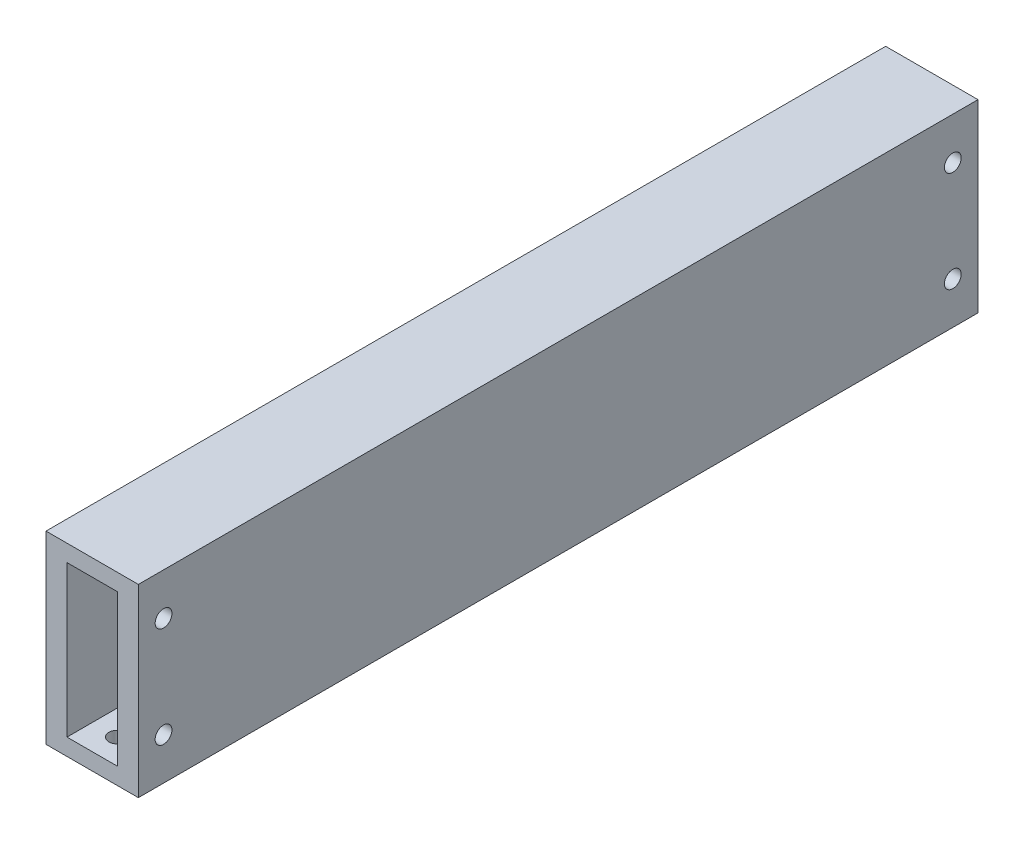
ISO-10303-21;
HEADER;
FILE_DESCRIPTION(('STEP AP214'),'2;1');
FILE_NAME('part.step','',(''),(''),'','','');
FILE_SCHEMA(('AUTOMOTIVE_DESIGN { 1 0 10303 214 1 1 1 1 }'));
ENDSEC;
DATA;
#1=APPLICATION_CONTEXT('core data for automotive mechanical design processes');
#2=APPLICATION_PROTOCOL_DEFINITION('international standard','automotive_design',2000,#1);
#3=PRODUCT_CONTEXT('',#1,'mechanical');
#4=PRODUCT('Part','Part','',(#3));
#5=PRODUCT_RELATED_PRODUCT_CATEGORY('part','',(#4));
#6=PRODUCT_DEFINITION_FORMATION('','',#4);
#7=PRODUCT_DEFINITION_CONTEXT('part definition',#1,'design');
#8=PRODUCT_DEFINITION('design','',#6,#7);
#9=PRODUCT_DEFINITION_SHAPE('','',#8);
#10=(LENGTH_UNIT() NAMED_UNIT(*) SI_UNIT(.MILLI.,.METRE.));
#11=(NAMED_UNIT(*) PLANE_ANGLE_UNIT() SI_UNIT($,.RADIAN.));
#12=(NAMED_UNIT(*) SI_UNIT($,.STERADIAN.) SOLID_ANGLE_UNIT());
#13=UNCERTAINTY_MEASURE_WITH_UNIT(LENGTH_MEASURE(1.E-05),#10,'distance_accuracy_value','');
#14=(GEOMETRIC_REPRESENTATION_CONTEXT(3) GLOBAL_UNCERTAINTY_ASSIGNED_CONTEXT((#13)) GLOBAL_UNIT_ASSIGNED_CONTEXT((#10,
#11,#12)) REPRESENTATION_CONTEXT('',''));
#15=CARTESIAN_POINT('',(0.,0.,0.));
#16=DIRECTION('',(0.,0.,1.));
#17=DIRECTION('',(1.,0.,0.));
#18=AXIS2_PLACEMENT_3D('',#15,#16,#17);
#19=CARTESIAN_POINT('',(-3.40129661339423,110.,34.4655431887367));
#20=DIRECTION('',(1.,0.,0.));
#21=DIRECTION('',(0.,0.,-1.));
#22=AXIS2_PLACEMENT_3D('',#19,#20,#21);
#23=PLANE('',#22);
#24=DIRECTION('',(0.,0.,1.));
#25=VECTOR('',#24,1.);
#26=CARTESIAN_POINT('',(-3.40129661339423,0.,34.4655431887367));
#27=LINE('',#26,#25);
#28=CARTESIAN_POINT('',(-3.40129661339423,0.,-465.534456811263));
#29=VERTEX_POINT('',#28);
#30=CARTESIAN_POINT('',(-3.40129661339423,0.,34.4655431887367));
#31=VERTEX_POINT('',#30);
#32=EDGE_CURVE('E132',#29,#31,#27,.T.);
#33=ORIENTED_EDGE('',*,*,#32,.T.);
#34=DIRECTION('',(0.,-1.,0.));
#35=VECTOR('',#34,1.);
#36=CARTESIAN_POINT('',(-3.40129661339423,110.,34.4655431887367));
#37=LINE('',#36,#35);
#38=CARTESIAN_POINT('',(-3.40129661339423,110.,34.4655431887367));
#39=VERTEX_POINT('',#38);
#40=EDGE_CURVE('E11',#39,#31,#37,.T.);
#41=ORIENTED_EDGE('',*,*,#40,.F.);
#42=DIRECTION('',(0.,0.,1.));
#43=VECTOR('',#42,1.);
#44=CARTESIAN_POINT('',(-3.40129661339423,110.,34.4655431887367));
#45=LINE('',#44,#43);
#46=CARTESIAN_POINT('',(-3.40129661339423,110.,-465.534456811263));
#47=VERTEX_POINT('',#46);
#48=EDGE_CURVE('E136',#47,#39,#45,.T.);
#49=ORIENTED_EDGE('',*,*,#48,.F.);
#50=DIRECTION('',(0.,-1.,0.));
#51=VECTOR('',#50,1.);
#52=CARTESIAN_POINT('',(-3.40129661339423,110.,-465.534456811263));
#53=LINE('',#52,#51);
#54=EDGE_CURVE('E146',#47,#29,#53,.T.);
#55=ORIENTED_EDGE('',*,*,#54,.T.);
#56=EDGE_LOOP('',(#33,#41,#49,#55));
#57=FACE_BOUND('',#56,.T.);
#58=ADVANCED_FACE('F32',(#57),#23,.F.);
#59=CARTESIAN_POINT('',(-3.40129661339423,110.,34.4655431887367));
#60=DIRECTION('',(0.,0.,-1.));
#61=DIRECTION('',(-1.,0.,0.));
#62=AXIS2_PLACEMENT_3D('',#59,#60,#61);
#63=PLANE('',#62);
#64=DIRECTION('',(0.,1.,0.));
#65=VECTOR('',#64,1.);
#66=CARTESIAN_POINT('',(39.0987033866058,0.,34.4655431887367));
#67=LINE('',#66,#65);
#68=CARTESIAN_POINT('',(39.0987033866058,10.,34.4655431887367));
#69=VERTEX_POINT('',#68);
#70=CARTESIAN_POINT('',(39.0987033866058,100.,34.4655431887367));
#71=VERTEX_POINT('',#70);
#72=EDGE_CURVE('E126',#69,#71,#67,.T.);
#73=ORIENTED_EDGE('',*,*,#72,.F.);
#74=DIRECTION('',(1.,0.,0.));
#75=VECTOR('',#74,1.);
#76=CARTESIAN_POINT('',(0.,10.,34.4655431887367));
#77=LINE('',#76,#75);
#78=CARTESIAN_POINT('',(9.09870338660576,10.,34.4655431887367));
#79=VERTEX_POINT('',#78);
#80=EDGE_CURVE('E48',#79,#69,#77,.T.);
#81=ORIENTED_EDGE('',*,*,#80,.F.);
#82=DIRECTION('',(0.,1.,0.));
#83=VECTOR('',#82,1.);
#84=CARTESIAN_POINT('',(9.09870338660576,0.,34.4655431887367));
#85=LINE('',#84,#83);
#86=CARTESIAN_POINT('',(9.09870338660576,100.,34.4655431887367));
#87=VERTEX_POINT('',#86);
#88=EDGE_CURVE('E114',#79,#87,#85,.T.);
#89=ORIENTED_EDGE('',*,*,#88,.T.);
#90=DIRECTION('',(1.,0.,0.));
#91=VECTOR('',#90,1.);
#92=CARTESIAN_POINT('',(0.,100.,34.4655431887367));
#93=LINE('',#92,#91);
#94=EDGE_CURVE('E117',#87,#71,#93,.T.);
#95=ORIENTED_EDGE('',*,*,#94,.T.);
#96=EDGE_LOOP('',(#73,#81,#89,#95));
#97=FACE_BOUND('',#96,.T.);
#98=DIRECTION('',(1.,0.,0.));
#99=VECTOR('',#98,1.);
#100=CARTESIAN_POINT('',(-3.40129661339423,0.,34.4655431887367));
#101=LINE('',#100,#99);
#102=CARTESIAN_POINT('',(51.5987033866058,0.,34.4655431887367));
#103=VERTEX_POINT('',#102);
#104=EDGE_CURVE('E149',#31,#103,#101,.T.);
#105=ORIENTED_EDGE('',*,*,#104,.T.);
#106=DIRECTION('',(0.,-1.,0.));
#107=VECTOR('',#106,1.);
#108=CARTESIAN_POINT('',(51.5987033866058,110.,34.4655431887367));
#109=LINE('',#108,#107);
#110=CARTESIAN_POINT('',(51.5987033866058,110.,34.4655431887367));
#111=VERTEX_POINT('',#110);
#112=EDGE_CURVE('E40',#111,#103,#109,.T.);
#113=ORIENTED_EDGE('',*,*,#112,.F.);
#114=DIRECTION('',(1.,0.,0.));
#115=VECTOR('',#114,1.);
#116=CARTESIAN_POINT('',(-3.40129661339423,110.,34.4655431887367));
#117=LINE('',#116,#115);
#118=EDGE_CURVE('E139',#39,#111,#117,.T.);
#119=ORIENTED_EDGE('',*,*,#118,.F.);
#120=ORIENTED_EDGE('',*,*,#40,.T.);
#121=EDGE_LOOP('',(#105,#113,#119,#120));
#122=FACE_BOUND('',#121,.T.);
#123=ADVANCED_FACE('F219',(#97,#122),#63,.F.);
#124=CARTESIAN_POINT('',(51.5987033866058,110.,34.4655431887367));
#125=DIRECTION('',(-1.,0.,0.));
#126=DIRECTION('',(0.,0.,1.));
#127=AXIS2_PLACEMENT_3D('',#124,#125,#126);
#128=PLANE('',#127);
#129=CARTESIAN_POINT('',(51.5987033866058,85.,-450.534456811263));
#130=DIRECTION('',(1.,0.,0.));
#131=DIRECTION('',(0.,0.,-1.));
#132=AXIS2_PLACEMENT_3D('',#129,#130,#131);
#133=CIRCLE('',#132,5.);
#134=CARTESIAN_POINT('',(51.5987033866058,85.,-455.534456811263));
#135=VERTEX_POINT('',#134);
#136=EDGE_CURVE('E177',#135,#135,#133,.T.);
#137=ORIENTED_EDGE('',*,*,#136,.F.);
#138=EDGE_LOOP('',(#137));
#139=FACE_BOUND('',#138,.T.);
#140=CARTESIAN_POINT('',(51.5987033866058,25.,-450.534456811263));
#141=DIRECTION('',(1.,0.,0.));
#142=DIRECTION('',(0.,0.,-1.));
#143=AXIS2_PLACEMENT_3D('',#140,#141,#142);
#144=CIRCLE('',#143,5.);
#145=CARTESIAN_POINT('',(51.5987033866058,25.,-455.534456811263));
#146=VERTEX_POINT('',#145);
#147=EDGE_CURVE('E167',#146,#146,#144,.T.);
#148=ORIENTED_EDGE('',*,*,#147,.F.);
#149=EDGE_LOOP('',(#148));
#150=FACE_BOUND('',#149,.T.);
#151=CARTESIAN_POINT('',(51.5987033866058,85.,19.4655431887367));
#152=DIRECTION('',(1.,0.,0.));
#153=DIRECTION('',(0.,0.,-1.));
#154=AXIS2_PLACEMENT_3D('',#151,#152,#153);
#155=CIRCLE('',#154,5.);
#156=CARTESIAN_POINT('',(51.5987033866058,85.,14.4655431887367));
#157=VERTEX_POINT('',#156);
#158=EDGE_CURVE('E164',#157,#157,#155,.T.);
#159=ORIENTED_EDGE('',*,*,#158,.F.);
#160=EDGE_LOOP('',(#159));
#161=FACE_BOUND('',#160,.T.);
#162=CARTESIAN_POINT('',(51.5987033866058,25.,19.4655431887367));
#163=DIRECTION('',(1.,0.,0.));
#164=DIRECTION('',(0.,0.,-1.));
#165=AXIS2_PLACEMENT_3D('',#162,#163,#164);
#166=CIRCLE('',#165,5.);
#167=CARTESIAN_POINT('',(51.5987033866058,25.,14.4655431887367));
#168=VERTEX_POINT('',#167);
#169=EDGE_CURVE('E163',#168,#168,#166,.T.);
#170=ORIENTED_EDGE('',*,*,#169,.F.);
#171=EDGE_LOOP('',(#170));
#172=FACE_BOUND('',#171,.T.);
#173=DIRECTION('',(0.,0.,-1.));
#174=VECTOR('',#173,1.);
#175=CARTESIAN_POINT('',(51.5987033866058,0.,34.4655431887367));
#176=LINE('',#175,#174);
#177=CARTESIAN_POINT('',(51.5987033866058,0.,-465.534456811263));
#178=VERTEX_POINT('',#177);
#179=EDGE_CURVE('E151',#103,#178,#176,.T.);
#180=ORIENTED_EDGE('',*,*,#179,.T.);
#181=DIRECTION('',(0.,-1.,0.));
#182=VECTOR('',#181,1.);
#183=CARTESIAN_POINT('',(51.5987033866058,110.,-465.534456811263));
#184=LINE('',#183,#182);
#185=CARTESIAN_POINT('',(51.5987033866058,110.,-465.534456811263));
#186=VERTEX_POINT('',#185);
#187=EDGE_CURVE('E156',#186,#178,#184,.T.);
#188=ORIENTED_EDGE('',*,*,#187,.F.);
#189=DIRECTION('',(0.,0.,-1.));
#190=VECTOR('',#189,1.);
#191=CARTESIAN_POINT('',(51.5987033866058,110.,34.4655431887367));
#192=LINE('',#191,#190);
#193=EDGE_CURVE('E142',#111,#186,#192,.T.);
#194=ORIENTED_EDGE('',*,*,#193,.F.);
#195=ORIENTED_EDGE('',*,*,#112,.T.);
#196=EDGE_LOOP('',(#180,#188,#194,#195));
#197=FACE_BOUND('',#196,.T.);
#198=ADVANCED_FACE('F216',(#139,#150,#161,#172,#197),#128,.F.);
#199=CARTESIAN_POINT('',(-3.40129661339423,110.,-465.534456811263));
#200=DIRECTION('',(0.,0.,1.));
#201=DIRECTION('',(1.,0.,0.));
#202=AXIS2_PLACEMENT_3D('',#199,#200,#201);
#203=PLANE('',#202);
#204=DIRECTION('',(0.,1.,0.));
#205=VECTOR('',#204,1.);
#206=CARTESIAN_POINT('',(9.09870338660576,0.,-465.534456811263));
#207=LINE('',#206,#205);
#208=CARTESIAN_POINT('',(9.09870338660576,10.,-465.534456811263));
#209=VERTEX_POINT('',#208);
#210=CARTESIAN_POINT('',(9.09870338660576,100.,-465.534456811263));
#211=VERTEX_POINT('',#210);
#212=EDGE_CURVE('E103',#209,#211,#207,.T.);
#213=ORIENTED_EDGE('',*,*,#212,.F.);
#214=DIRECTION('',(1.,0.,0.));
#215=VECTOR('',#214,1.);
#216=CARTESIAN_POINT('',(0.,10.,-465.534456811263));
#217=LINE('',#216,#215);
#218=CARTESIAN_POINT('',(39.0987033866058,10.,-465.534456811263));
#219=VERTEX_POINT('',#218);
#220=EDGE_CURVE('E100',#209,#219,#217,.T.);
#221=ORIENTED_EDGE('',*,*,#220,.T.);
#222=DIRECTION('',(0.,1.,0.));
#223=VECTOR('',#222,1.);
#224=CARTESIAN_POINT('',(39.0987033866058,0.,-465.534456811263));
#225=LINE('',#224,#223);
#226=CARTESIAN_POINT('',(39.0987033866058,100.,-465.534456811263));
#227=VERTEX_POINT('',#226);
#228=EDGE_CURVE('E106',#219,#227,#225,.T.);
#229=ORIENTED_EDGE('',*,*,#228,.T.);
#230=DIRECTION('',(1.,0.,0.));
#231=VECTOR('',#230,1.);
#232=CARTESIAN_POINT('',(0.,100.,-465.534456811263));
#233=LINE('',#232,#231);
#234=EDGE_CURVE('E110',#211,#227,#233,.T.);
#235=ORIENTED_EDGE('',*,*,#234,.F.);
#236=EDGE_LOOP('',(#213,#221,#229,#235));
#237=FACE_BOUND('',#236,.T.);
#238=DIRECTION('',(-1.,0.,0.));
#239=VECTOR('',#238,1.);
#240=CARTESIAN_POINT('',(-3.40129661339423,0.,-465.534456811263));
#241=LINE('',#240,#239);
#242=EDGE_CURVE('E140',#178,#29,#241,.T.);
#243=ORIENTED_EDGE('',*,*,#242,.T.);
#244=ORIENTED_EDGE('',*,*,#54,.F.);
#245=DIRECTION('',(-1.,0.,0.));
#246=VECTOR('',#245,1.);
#247=CARTESIAN_POINT('',(-3.40129661339423,110.,-465.534456811263));
#248=LINE('',#247,#246);
#249=EDGE_CURVE('E144',#186,#47,#248,.T.);
#250=ORIENTED_EDGE('',*,*,#249,.F.);
#251=ORIENTED_EDGE('',*,*,#187,.T.);
#252=EDGE_LOOP('',(#243,#244,#250,#251));
#253=FACE_BOUND('',#252,.T.);
#254=ADVANCED_FACE('F112',(#237,#253),#203,.F.);
#255=CARTESIAN_POINT('',(0.,110.,0.));
#256=DIRECTION('',(0.,-1.,0.));
#257=DIRECTION('',(0.,0.,-1.));
#258=AXIS2_PLACEMENT_3D('',#255,#256,#257);
#259=PLANE('',#258);
#260=ORIENTED_EDGE('',*,*,#48,.T.);
#261=ORIENTED_EDGE('',*,*,#118,.T.);
#262=ORIENTED_EDGE('',*,*,#193,.T.);
#263=ORIENTED_EDGE('',*,*,#249,.T.);
#264=EDGE_LOOP('',(#260,#261,#262,#263));
#265=FACE_BOUND('',#264,.T.);
#266=ADVANCED_FACE('F202',(#265),#259,.F.);
#267=CARTESIAN_POINT('',(0.,0.,0.));
#268=DIRECTION('',(0.,-1.,0.));
#269=DIRECTION('',(0.,0.,-1.));
#270=AXIS2_PLACEMENT_3D('',#267,#268,#269);
#271=PLANE('',#270);
#272=CARTESIAN_POINT('',(24.0987033866058,0.,-450.534456811263));
#273=DIRECTION('',(0.,-1.,0.));
#274=DIRECTION('',(0.,0.,-1.));
#275=AXIS2_PLACEMENT_3D('',#272,#273,#274);
#276=CIRCLE('',#275,5.);
#277=CARTESIAN_POINT('',(24.0987033866058,0.,-455.534456811263));
#278=VERTEX_POINT('',#277);
#279=EDGE_CURVE('E188',#278,#278,#276,.T.);
#280=ORIENTED_EDGE('',*,*,#279,.F.);
#281=EDGE_LOOP('',(#280));
#282=FACE_BOUND('',#281,.T.);
#283=CARTESIAN_POINT('',(24.0987033866058,0.,19.4655431887367));
#284=DIRECTION('',(0.,-1.,0.));
#285=DIRECTION('',(0.,0.,-1.));
#286=AXIS2_PLACEMENT_3D('',#283,#284,#285);
#287=CIRCLE('',#286,5.);
#288=CARTESIAN_POINT('',(24.0987033866058,0.,14.4655431887367));
#289=VERTEX_POINT('',#288);
#290=EDGE_CURVE('E120',#289,#289,#287,.T.);
#291=ORIENTED_EDGE('',*,*,#290,.F.);
#292=EDGE_LOOP('',(#291));
#293=FACE_BOUND('',#292,.T.);
#294=ORIENTED_EDGE('',*,*,#32,.F.);
#295=ORIENTED_EDGE('',*,*,#242,.F.);
#296=ORIENTED_EDGE('',*,*,#179,.F.);
#297=ORIENTED_EDGE('',*,*,#104,.F.);
#298=EDGE_LOOP('',(#294,#295,#296,#297));
#299=FACE_BOUND('',#298,.T.);
#300=ADVANCED_FACE('F199',(#282,#293,#299),#271,.T.);
#301=CARTESIAN_POINT('',(0.,10.,-465.534456811263));
#302=DIRECTION('',(0.,-1.,0.));
#303=DIRECTION('',(0.,0.,-1.));
#304=AXIS2_PLACEMENT_3D('',#301,#302,#303);
#305=PLANE('',#304);
#306=CARTESIAN_POINT('',(24.0987033866058,10.,-450.534456811263));
#307=DIRECTION('',(0.,1.,0.));
#308=DIRECTION('',(0.,0.,1.));
#309=AXIS2_PLACEMENT_3D('',#306,#307,#308);
#310=CIRCLE('',#309,5.);
#311=CARTESIAN_POINT('',(24.0987033866058,10.,-445.534456811263));
#312=VERTEX_POINT('',#311);
#313=EDGE_CURVE('E185',#312,#312,#310,.T.);
#314=ORIENTED_EDGE('',*,*,#313,.F.);
#315=EDGE_LOOP('',(#314));
#316=FACE_BOUND('',#315,.T.);
#317=CARTESIAN_POINT('',(24.0987033866058,10.,19.4655431887367));
#318=DIRECTION('',(0.,1.,0.));
#319=DIRECTION('',(0.,0.,1.));
#320=AXIS2_PLACEMENT_3D('',#317,#318,#319);
#321=CIRCLE('',#320,5.);
#322=CARTESIAN_POINT('',(24.0987033866058,10.,24.4655431887367));
#323=VERTEX_POINT('',#322);
#324=EDGE_CURVE('E190',#323,#323,#321,.T.);
#325=ORIENTED_EDGE('',*,*,#324,.F.);
#326=EDGE_LOOP('',(#325));
#327=FACE_BOUND('',#326,.T.);
#328=ORIENTED_EDGE('',*,*,#80,.T.);
#329=DIRECTION('',(0.,0.,1.));
#330=VECTOR('',#329,1.);
#331=CARTESIAN_POINT('',(39.0987033866058,10.,-465.534456811263));
#332=LINE('',#331,#330);
#333=EDGE_CURVE('E97',#219,#69,#332,.T.);
#334=ORIENTED_EDGE('',*,*,#333,.F.);
#335=ORIENTED_EDGE('',*,*,#220,.F.);
#336=DIRECTION('',(0.,0.,1.));
#337=VECTOR('',#336,1.);
#338=CARTESIAN_POINT('',(9.09870338660576,10.,-465.534456811263));
#339=LINE('',#338,#337);
#340=EDGE_CURVE('E130',#209,#79,#339,.T.);
#341=ORIENTED_EDGE('',*,*,#340,.T.);
#342=EDGE_LOOP('',(#328,#334,#335,#341));
#343=FACE_BOUND('',#342,.T.);
#344=ADVANCED_FACE('F98',(#316,#327,#343),#305,.F.);
#345=CARTESIAN_POINT('',(9.09870338660576,0.,-465.534456811263));
#346=DIRECTION('',(1.,0.,0.));
#347=DIRECTION('',(0.,0.,-1.));
#348=AXIS2_PLACEMENT_3D('',#345,#346,#347);
#349=PLANE('',#348);
#350=ORIENTED_EDGE('',*,*,#88,.F.);
#351=ORIENTED_EDGE('',*,*,#340,.F.);
#352=ORIENTED_EDGE('',*,*,#212,.T.);
#353=DIRECTION('',(0.,0.,1.));
#354=VECTOR('',#353,1.);
#355=CARTESIAN_POINT('',(9.09870338660576,100.,-465.534456811263));
#356=LINE('',#355,#354);
#357=EDGE_CURVE('E133',#211,#87,#356,.T.);
#358=ORIENTED_EDGE('',*,*,#357,.T.);
#359=EDGE_LOOP('',(#350,#351,#352,#358));
#360=FACE_BOUND('',#359,.T.);
#361=ADVANCED_FACE('F244',(#360),#349,.T.);
#362=CARTESIAN_POINT('',(0.,100.,-465.534456811263));
#363=DIRECTION('',(0.,-1.,0.));
#364=DIRECTION('',(0.,0.,-1.));
#365=AXIS2_PLACEMENT_3D('',#362,#363,#364);
#366=PLANE('',#365);
#367=ORIENTED_EDGE('',*,*,#94,.F.);
#368=ORIENTED_EDGE('',*,*,#357,.F.);
#369=ORIENTED_EDGE('',*,*,#234,.T.);
#370=DIRECTION('',(0.,0.,1.));
#371=VECTOR('',#370,1.);
#372=CARTESIAN_POINT('',(39.0987033866058,100.,-465.534456811263));
#373=LINE('',#372,#371);
#374=EDGE_CURVE('E56',#227,#71,#373,.T.);
#375=ORIENTED_EDGE('',*,*,#374,.T.);
#376=EDGE_LOOP('',(#367,#368,#369,#375));
#377=FACE_BOUND('',#376,.T.);
#378=ADVANCED_FACE('F242',(#377),#366,.T.);
#379=CARTESIAN_POINT('',(39.0987033866058,0.,-465.534456811263));
#380=DIRECTION('',(1.,0.,0.));
#381=DIRECTION('',(0.,0.,-1.));
#382=AXIS2_PLACEMENT_3D('',#379,#380,#381);
#383=PLANE('',#382);
#384=CARTESIAN_POINT('',(39.0987033866058,85.,-450.534456811263));
#385=DIRECTION('',(1.,0.,0.));
#386=DIRECTION('',(0.,0.,-1.));
#387=AXIS2_PLACEMENT_3D('',#384,#385,#386);
#388=CIRCLE('',#387,5.);
#389=CARTESIAN_POINT('',(39.0987033866058,85.,-455.534456811263));
#390=VERTEX_POINT('',#389);
#391=EDGE_CURVE('E35',#390,#390,#388,.T.);
#392=ORIENTED_EDGE('',*,*,#391,.T.);
#393=EDGE_LOOP('',(#392));
#394=FACE_BOUND('',#393,.T.);
#395=CARTESIAN_POINT('',(39.0987033866058,25.,-450.534456811263));
#396=DIRECTION('',(1.,0.,0.));
#397=DIRECTION('',(0.,0.,-1.));
#398=AXIS2_PLACEMENT_3D('',#395,#396,#397);
#399=CIRCLE('',#398,5.);
#400=CARTESIAN_POINT('',(39.0987033866058,25.,-455.534456811263));
#401=VERTEX_POINT('',#400);
#402=EDGE_CURVE('E165',#401,#401,#399,.T.);
#403=ORIENTED_EDGE('',*,*,#402,.T.);
#404=EDGE_LOOP('',(#403));
#405=FACE_BOUND('',#404,.T.);
#406=CARTESIAN_POINT('',(39.0987033866058,85.,19.4655431887367));
#407=DIRECTION('',(1.,0.,0.));
#408=DIRECTION('',(0.,0.,-1.));
#409=AXIS2_PLACEMENT_3D('',#406,#407,#408);
#410=CIRCLE('',#409,5.);
#411=CARTESIAN_POINT('',(39.0987033866058,85.,14.4655431887367));
#412=VERTEX_POINT('',#411);
#413=EDGE_CURVE('E161',#412,#412,#410,.T.);
#414=ORIENTED_EDGE('',*,*,#413,.T.);
#415=EDGE_LOOP('',(#414));
#416=FACE_BOUND('',#415,.T.);
#417=CARTESIAN_POINT('',(39.0987033866058,25.,19.4655431887367));
#418=DIRECTION('',(1.,0.,0.));
#419=DIRECTION('',(0.,0.,-1.));
#420=AXIS2_PLACEMENT_3D('',#417,#418,#419);
#421=CIRCLE('',#420,5.);
#422=CARTESIAN_POINT('',(39.0987033866058,25.,14.4655431887367));
#423=VERTEX_POINT('',#422);
#424=EDGE_CURVE('E182',#423,#423,#421,.T.);
#425=ORIENTED_EDGE('',*,*,#424,.T.);
#426=EDGE_LOOP('',(#425));
#427=FACE_BOUND('',#426,.T.);
#428=ORIENTED_EDGE('',*,*,#72,.T.);
#429=ORIENTED_EDGE('',*,*,#374,.F.);
#430=ORIENTED_EDGE('',*,*,#228,.F.);
#431=ORIENTED_EDGE('',*,*,#333,.T.);
#432=EDGE_LOOP('',(#428,#429,#430,#431));
#433=FACE_BOUND('',#432,.T.);
#434=ADVANCED_FACE('F107',(#394,#405,#416,#427,#433),#383,.F.);
#435=CARTESIAN_POINT('',(24.0987033866058,10.,19.4655431887367));
#436=DIRECTION('',(0.,1.,0.));
#437=DIRECTION('',(0.,0.,1.));
#438=AXIS2_PLACEMENT_3D('',#435,#436,#437);
#439=CYLINDRICAL_SURFACE('',#438,5.);
#440=ORIENTED_EDGE('',*,*,#290,.T.);
#441=EDGE_LOOP('',(#440));
#442=FACE_BOUND('',#441,.T.);
#443=ORIENTED_EDGE('',*,*,#324,.T.);
#444=EDGE_LOOP('',(#443));
#445=FACE_BOUND('',#444,.T.);
#446=ADVANCED_FACE('F197',(#442,#445),#439,.F.);
#447=CARTESIAN_POINT('',(24.0987033866058,10.,-450.534456811263));
#448=DIRECTION('',(0.,1.,0.));
#449=DIRECTION('',(0.,0.,1.));
#450=AXIS2_PLACEMENT_3D('',#447,#448,#449);
#451=CYLINDRICAL_SURFACE('',#450,5.);
#452=ORIENTED_EDGE('',*,*,#279,.T.);
#453=EDGE_LOOP('',(#452));
#454=FACE_BOUND('',#453,.T.);
#455=ORIENTED_EDGE('',*,*,#313,.T.);
#456=EDGE_LOOP('',(#455));
#457=FACE_BOUND('',#456,.T.);
#458=ADVANCED_FACE('F261',(#454,#457),#451,.F.);
#459=CARTESIAN_POINT('',(51.5987033866058,25.,19.4655431887367));
#460=DIRECTION('',(1.,0.,0.));
#461=DIRECTION('',(0.,0.,-1.));
#462=AXIS2_PLACEMENT_3D('',#459,#460,#461);
#463=CYLINDRICAL_SURFACE('',#462,5.);
#464=ORIENTED_EDGE('',*,*,#169,.T.);
#465=EDGE_LOOP('',(#464));
#466=FACE_BOUND('',#465,.T.);
#467=ORIENTED_EDGE('',*,*,#424,.F.);
#468=EDGE_LOOP('',(#467));
#469=FACE_BOUND('',#468,.T.);
#470=ADVANCED_FACE('F268',(#466,#469),#463,.F.);
#471=CARTESIAN_POINT('',(51.5987033866058,85.,19.4655431887367));
#472=DIRECTION('',(1.,0.,0.));
#473=DIRECTION('',(0.,0.,-1.));
#474=AXIS2_PLACEMENT_3D('',#471,#472,#473);
#475=CYLINDRICAL_SURFACE('',#474,5.);
#476=ORIENTED_EDGE('',*,*,#158,.T.);
#477=EDGE_LOOP('',(#476));
#478=FACE_BOUND('',#477,.T.);
#479=ORIENTED_EDGE('',*,*,#413,.F.);
#480=EDGE_LOOP('',(#479));
#481=FACE_BOUND('',#480,.T.);
#482=ADVANCED_FACE('F270',(#478,#481),#475,.F.);
#483=CARTESIAN_POINT('',(51.5987033866058,25.,-450.534456811263));
#484=DIRECTION('',(1.,0.,0.));
#485=DIRECTION('',(0.,0.,-1.));
#486=AXIS2_PLACEMENT_3D('',#483,#484,#485);
#487=CYLINDRICAL_SURFACE('',#486,5.);
#488=ORIENTED_EDGE('',*,*,#147,.T.);
#489=EDGE_LOOP('',(#488));
#490=FACE_BOUND('',#489,.T.);
#491=ORIENTED_EDGE('',*,*,#402,.F.);
#492=EDGE_LOOP('',(#491));
#493=FACE_BOUND('',#492,.T.);
#494=ADVANCED_FACE('F277',(#490,#493),#487,.F.);
#495=CARTESIAN_POINT('',(51.5987033866058,85.,-450.534456811263));
#496=DIRECTION('',(1.,0.,0.));
#497=DIRECTION('',(0.,0.,-1.));
#498=AXIS2_PLACEMENT_3D('',#495,#496,#497);
#499=CYLINDRICAL_SURFACE('',#498,5.);
#500=ORIENTED_EDGE('',*,*,#136,.T.);
#501=EDGE_LOOP('',(#500));
#502=FACE_BOUND('',#501,.T.);
#503=ORIENTED_EDGE('',*,*,#391,.F.);
#504=EDGE_LOOP('',(#503));
#505=FACE_BOUND('',#504,.T.);
#506=ADVANCED_FACE('F284',(#502,#505),#499,.F.);
#507=CLOSED_SHELL('',(#58,#123,#198,#254,#266,#300,#344,#361,#378,#434,#446,#458,#470,#482,#494,#506));
#508=MANIFOLD_SOLID_BREP('B2',#507);
#509=ADVANCED_BREP_SHAPE_REPRESENTATION('',(#18,#508),#14);
#510=SHAPE_DEFINITION_REPRESENTATION(#9,#509);
ENDSEC;
END-ISO-10303-21;
